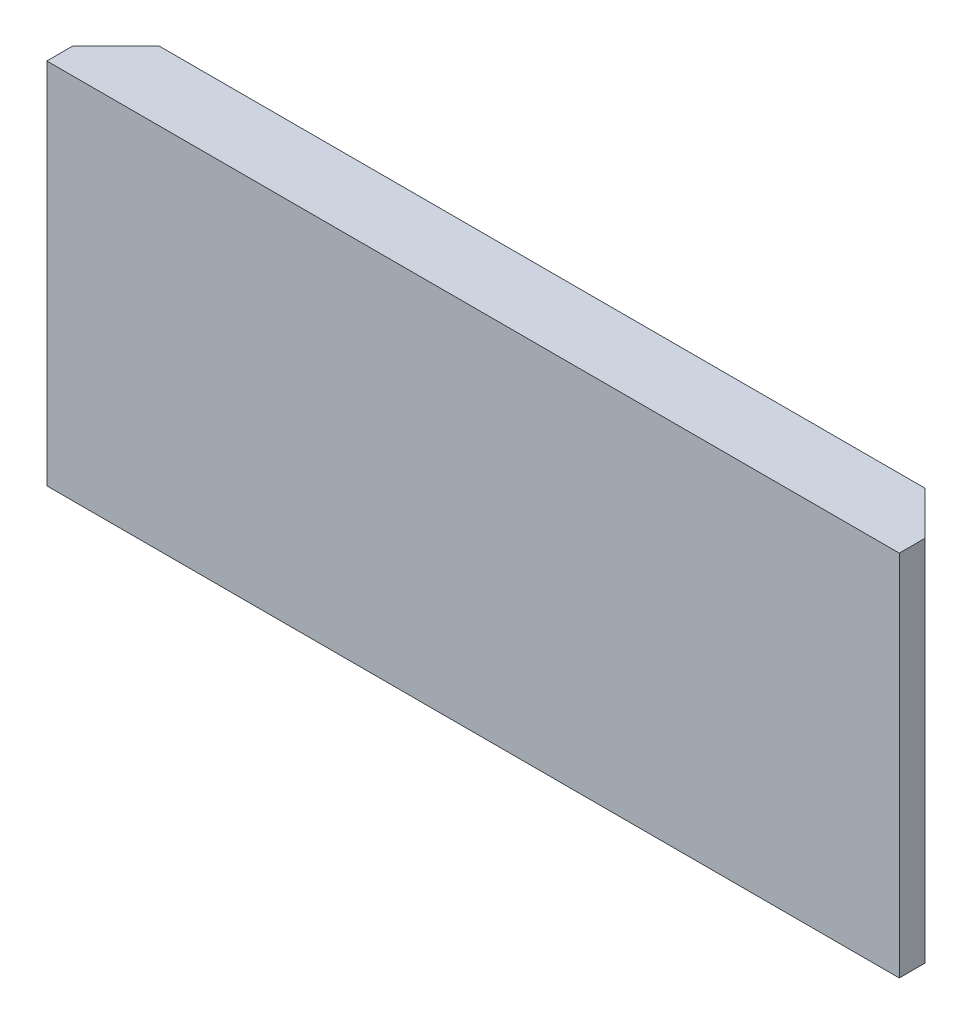
ISO-10303-21;
HEADER;
FILE_DESCRIPTION(('STEP AP214'),'2;1');
FILE_NAME('part.step','',(''),(''),'','','');
FILE_SCHEMA(('AUTOMOTIVE_DESIGN { 1 0 10303 214 1 1 1 1 }'));
ENDSEC;
DATA;
#1=APPLICATION_CONTEXT('core data for automotive mechanical design processes');
#2=APPLICATION_PROTOCOL_DEFINITION('international standard','automotive_design',2000,#1);
#3=PRODUCT_CONTEXT('',#1,'mechanical');
#4=PRODUCT('Part','Part','',(#3));
#5=PRODUCT_RELATED_PRODUCT_CATEGORY('part','',(#4));
#6=PRODUCT_DEFINITION_FORMATION('','',#4);
#7=PRODUCT_DEFINITION_CONTEXT('part definition',#1,'design');
#8=PRODUCT_DEFINITION('design','',#6,#7);
#9=PRODUCT_DEFINITION_SHAPE('','',#8);
#10=(LENGTH_UNIT() NAMED_UNIT(*) SI_UNIT(.MILLI.,.METRE.));
#11=(NAMED_UNIT(*) PLANE_ANGLE_UNIT() SI_UNIT($,.RADIAN.));
#12=(NAMED_UNIT(*) SI_UNIT($,.STERADIAN.) SOLID_ANGLE_UNIT());
#13=UNCERTAINTY_MEASURE_WITH_UNIT(LENGTH_MEASURE(1.E-05),#10,'distance_accuracy_value','');
#14=(GEOMETRIC_REPRESENTATION_CONTEXT(3) GLOBAL_UNCERTAINTY_ASSIGNED_CONTEXT((#13)) GLOBAL_UNIT_ASSIGNED_CONTEXT((#10,
#11,#12)) REPRESENTATION_CONTEXT('',''));
#15=CARTESIAN_POINT('',(0.,0.,0.));
#16=DIRECTION('',(0.,0.,1.));
#17=DIRECTION('',(1.,0.,0.));
#18=AXIS2_PLACEMENT_3D('',#15,#16,#17);
#19=CARTESIAN_POINT('',(0.,0.,0.));
#20=DIRECTION('',(0.,0.,1.));
#21=DIRECTION('',(1.,0.,0.));
#22=AXIS2_PLACEMENT_3D('',#19,#20,#21);
#23=PLANE('',#22);
#24=DIRECTION('',(-1.,0.,0.));
#25=VECTOR('',#24,1.);
#26=CARTESIAN_POINT('',(0.,37.19439999931,0.));
#27=LINE('',#26,#25);
#28=CARTESIAN_POINT('',(119.05,37.19439999931,0.));
#29=VERTEX_POINT('',#28);
#30=CARTESIAN_POINT('',(-78.35,37.19439999931,0.));
#31=VERTEX_POINT('',#30);
#32=EDGE_CURVE('E11',#29,#31,#27,.T.);
#33=ORIENTED_EDGE('',*,*,#32,.F.);
#34=DIRECTION('',(0.,1.,0.));
#35=VECTOR('',#34,1.);
#36=CARTESIAN_POINT('',(119.05,47.19439999931,0.));
#37=LINE('',#36,#35);
#38=CARTESIAN_POINT('',(119.05,-38.0149669770275,0.));
#39=VERTEX_POINT('',#38);
#40=EDGE_CURVE('E135',#39,#29,#37,.T.);
#41=ORIENTED_EDGE('',*,*,#40,.F.);
#42=DIRECTION('',(1.,0.,0.));
#43=VECTOR('',#42,1.);
#44=CARTESIAN_POINT('',(-78.35,-38.0149669770275,0.));
#45=LINE('',#44,#43);
#46=CARTESIAN_POINT('',(-78.35,-38.0149669770275,0.));
#47=VERTEX_POINT('',#46);
#48=EDGE_CURVE('E72',#47,#39,#45,.T.);
#49=ORIENTED_EDGE('',*,*,#48,.F.);
#50=DIRECTION('',(0.,-1.,0.));
#51=VECTOR('',#50,1.);
#52=CARTESIAN_POINT('',(-78.35,47.19439999931,0.));
#53=LINE('',#52,#51);
#54=EDGE_CURVE('E136',#31,#47,#53,.T.);
#55=ORIENTED_EDGE('',*,*,#54,.F.);
#56=EDGE_LOOP('',(#33,#41,#49,#55));
#57=FACE_BOUND('',#56,.T.);
#58=ADVANCED_FACE('F39',(#57),#23,.F.);
#59=CARTESIAN_POINT('',(-78.35,47.19439999931,6.));
#60=DIRECTION('',(1.,0.,0.));
#61=DIRECTION('',(0.,1.,0.));
#62=AXIS2_PLACEMENT_3D('',#59,#60,#61);
#63=PLANE('',#62);
#64=CARTESIAN_POINT('',(-78.35,47.19439999931,0.));
#65=VERTEX_POINT('',#64);
#66=EDGE_CURVE('E147',#65,#31,#53,.T.);
#67=ORIENTED_EDGE('',*,*,#66,.T.);
#68=ORIENTED_EDGE('',*,*,#54,.T.);
#69=DIRECTION('',(0.,0.,-1.));
#70=VECTOR('',#69,1.);
#71=CARTESIAN_POINT('',(-78.35,-38.0149669770275,6.));
#72=LINE('',#71,#70);
#73=CARTESIAN_POINT('',(-78.35,-38.0149669770275,6.));
#74=VERTEX_POINT('',#73);
#75=EDGE_CURVE('E49',#74,#47,#72,.T.);
#76=ORIENTED_EDGE('',*,*,#75,.F.);
#77=DIRECTION('',(0.,-1.,0.));
#78=VECTOR('',#77,1.);
#79=CARTESIAN_POINT('',(-78.35,47.19439999931,6.));
#80=LINE('',#79,#78);
#81=CARTESIAN_POINT('',(-78.35,47.19439999931,6.));
#82=VERTEX_POINT('',#81);
#83=EDGE_CURVE('E84',#82,#74,#80,.T.);
#84=ORIENTED_EDGE('',*,*,#83,.F.);
#85=DIRECTION('',(0.,0.,-1.));
#86=VECTOR('',#85,1.);
#87=CARTESIAN_POINT('',(-78.35,47.19439999931,6.));
#88=LINE('',#87,#86);
#89=EDGE_CURVE('E151',#82,#65,#88,.T.);
#90=ORIENTED_EDGE('',*,*,#89,.T.);
#91=EDGE_LOOP('',(#67,#68,#76,#84,#90));
#92=FACE_BOUND('',#91,.T.);
#93=ADVANCED_FACE('F41',(#92),#63,.F.);
#94=CARTESIAN_POINT('',(-78.35,-38.0149669770275,6.));
#95=DIRECTION('',(0.,1.,0.));
#96=DIRECTION('',(0.,0.,1.));
#97=AXIS2_PLACEMENT_3D('',#94,#95,#96);
#98=PLANE('',#97);
#99=ORIENTED_EDGE('',*,*,#48,.T.);
#100=DIRECTION('',(0.,0.,-1.));
#101=VECTOR('',#100,1.);
#102=CARTESIAN_POINT('',(119.05,-38.0149669770275,6.));
#103=LINE('',#102,#101);
#104=CARTESIAN_POINT('',(119.05,-38.0149669770275,6.));
#105=VERTEX_POINT('',#104);
#106=EDGE_CURVE('E140',#105,#39,#103,.T.);
#107=ORIENTED_EDGE('',*,*,#106,.F.);
#108=DIRECTION('',(1.,0.,0.));
#109=VECTOR('',#108,1.);
#110=CARTESIAN_POINT('',(-78.35,-38.0149669770275,6.));
#111=LINE('',#110,#109);
#112=EDGE_CURVE('E145',#74,#105,#111,.T.);
#113=ORIENTED_EDGE('',*,*,#112,.F.);
#114=ORIENTED_EDGE('',*,*,#75,.T.);
#115=EDGE_LOOP('',(#99,#107,#113,#114));
#116=FACE_BOUND('',#115,.T.);
#117=ADVANCED_FACE('F161',(#116),#98,.F.);
#118=CARTESIAN_POINT('',(119.05,47.19439999931,6.));
#119=DIRECTION('',(-1.,0.,0.));
#120=DIRECTION('',(0.,0.,1.));
#121=AXIS2_PLACEMENT_3D('',#118,#119,#120);
#122=PLANE('',#121);
#123=DIRECTION('',(0.,0.,-1.));
#124=VECTOR('',#123,1.);
#125=CARTESIAN_POINT('',(119.05,47.19439999931,6.));
#126=LINE('',#125,#124);
#127=CARTESIAN_POINT('',(119.05,47.19439999931,6.));
#128=VERTEX_POINT('',#127);
#129=CARTESIAN_POINT('',(119.05,47.19439999931,0.));
#130=VERTEX_POINT('',#129);
#131=EDGE_CURVE('E155',#128,#130,#126,.T.);
#132=ORIENTED_EDGE('',*,*,#131,.F.);
#133=DIRECTION('',(0.,1.,0.));
#134=VECTOR('',#133,1.);
#135=CARTESIAN_POINT('',(119.05,47.19439999931,6.));
#136=LINE('',#135,#134);
#137=EDGE_CURVE('E171',#105,#128,#136,.T.);
#138=ORIENTED_EDGE('',*,*,#137,.F.);
#139=ORIENTED_EDGE('',*,*,#106,.T.);
#140=ORIENTED_EDGE('',*,*,#40,.T.);
#141=DIRECTION('',(0.,1.,0.));
#142=VECTOR('',#141,1.);
#143=CARTESIAN_POINT('',(119.05,37.19439999931,0.));
#144=LINE('',#143,#142);
#145=EDGE_CURVE('E108',#29,#130,#144,.T.);
#146=ORIENTED_EDGE('',*,*,#145,.T.);
#147=EDGE_LOOP('',(#132,#138,#139,#140,#146));
#148=FACE_BOUND('',#147,.T.);
#149=ADVANCED_FACE('F138',(#148),#122,.F.);
#150=CARTESIAN_POINT('',(-78.35,47.19439999931,6.));
#151=DIRECTION('',(0.,-1.,0.));
#152=DIRECTION('',(0.,0.,-1.));
#153=AXIS2_PLACEMENT_3D('',#150,#151,#152);
#154=PLANE('',#153);
#155=ORIENTED_EDGE('',*,*,#131,.T.);
#156=DIRECTION('',(-0.707106781186553,0.,-0.707106781186542));
#157=VECTOR('',#156,1.);
#158=CARTESIAN_POINT('',(119.05,47.19439999931,0.));
#159=LINE('',#158,#157);
#160=CARTESIAN_POINT('',(109.05,47.19439999931,-10.));
#161=VERTEX_POINT('',#160);
#162=EDGE_CURVE('E113',#130,#161,#159,.T.);
#163=ORIENTED_EDGE('',*,*,#162,.T.);
#164=DIRECTION('',(-1.,0.,0.));
#165=VECTOR('',#164,1.);
#166=CARTESIAN_POINT('',(-68.35,47.19439999931,-10.));
#167=LINE('',#166,#165);
#168=CARTESIAN_POINT('',(-68.35,47.19439999931,-10.));
#169=VERTEX_POINT('',#168);
#170=EDGE_CURVE('E180',#161,#169,#167,.T.);
#171=ORIENTED_EDGE('',*,*,#170,.T.);
#172=DIRECTION('',(-0.707106781186546,0.,0.707106781186549));
#173=VECTOR('',#172,1.);
#174=CARTESIAN_POINT('',(-78.35,47.19439999931,0.));
#175=LINE('',#174,#173);
#176=EDGE_CURVE('E79',#169,#65,#175,.T.);
#177=ORIENTED_EDGE('',*,*,#176,.T.);
#178=ORIENTED_EDGE('',*,*,#89,.F.);
#179=DIRECTION('',(-1.,0.,0.));
#180=VECTOR('',#179,1.);
#181=CARTESIAN_POINT('',(-78.35,47.19439999931,6.));
#182=LINE('',#181,#180);
#183=EDGE_CURVE('E57',#128,#82,#182,.T.);
#184=ORIENTED_EDGE('',*,*,#183,.F.);
#185=EDGE_LOOP('',(#155,#163,#171,#177,#178,#184));
#186=FACE_BOUND('',#185,.T.);
#187=ADVANCED_FACE('F193',(#186),#154,.F.);
#188=CARTESIAN_POINT('',(0.,0.,6.));
#189=DIRECTION('',(0.,0.,1.));
#190=DIRECTION('',(1.,0.,0.));
#191=AXIS2_PLACEMENT_3D('',#188,#189,#190);
#192=PLANE('',#191);
#193=ORIENTED_EDGE('',*,*,#83,.T.);
#194=ORIENTED_EDGE('',*,*,#112,.T.);
#195=ORIENTED_EDGE('',*,*,#137,.T.);
#196=ORIENTED_EDGE('',*,*,#183,.T.);
#197=EDGE_LOOP('',(#193,#194,#195,#196));
#198=FACE_BOUND('',#197,.T.);
#199=ADVANCED_FACE('F194',(#198),#192,.T.);
#200=CARTESIAN_POINT('',(0.,37.19439999931,0.));
#201=DIRECTION('',(0.,1.,0.));
#202=DIRECTION('',(0.,0.,1.));
#203=AXIS2_PLACEMENT_3D('',#200,#201,#202);
#204=PLANE('',#203);
#205=DIRECTION('',(-0.707106781186553,0.,-0.707106781186542));
#206=VECTOR('',#205,1.);
#207=CARTESIAN_POINT('',(119.05,37.19439999931,0.));
#208=LINE('',#207,#206);
#209=CARTESIAN_POINT('',(109.05,37.19439999931,-10.));
#210=VERTEX_POINT('',#209);
#211=EDGE_CURVE('E111',#29,#210,#208,.T.);
#212=ORIENTED_EDGE('',*,*,#211,.F.);
#213=ORIENTED_EDGE('',*,*,#32,.T.);
#214=DIRECTION('',(-0.707106781186546,0.,0.707106781186549));
#215=VECTOR('',#214,1.);
#216=CARTESIAN_POINT('',(-78.35,37.19439999931,0.));
#217=LINE('',#216,#215);
#218=CARTESIAN_POINT('',(-68.35,37.19439999931,-10.));
#219=VERTEX_POINT('',#218);
#220=EDGE_CURVE('E120',#219,#31,#217,.T.);
#221=ORIENTED_EDGE('',*,*,#220,.F.);
#222=DIRECTION('',(-1.,0.,0.));
#223=VECTOR('',#222,1.);
#224=CARTESIAN_POINT('',(-68.35,37.19439999931,-10.));
#225=LINE('',#224,#223);
#226=EDGE_CURVE('E129',#210,#219,#225,.T.);
#227=ORIENTED_EDGE('',*,*,#226,.F.);
#228=EDGE_LOOP('',(#212,#213,#221,#227));
#229=FACE_BOUND('',#228,.T.);
#230=ADVANCED_FACE('F125',(#229),#204,.F.);
#231=CARTESIAN_POINT('',(-78.35,37.19439999931,0.));
#232=DIRECTION('',(-0.707106781186549,0.,-0.707106781186546));
#233=DIRECTION('',(-0.707106781186546,0.,0.707106781186549));
#234=AXIS2_PLACEMENT_3D('',#231,#232,#233);
#235=PLANE('',#234);
#236=ORIENTED_EDGE('',*,*,#176,.F.);
#237=DIRECTION('',(0.,1.,0.));
#238=VECTOR('',#237,1.);
#239=CARTESIAN_POINT('',(-68.35,37.19439999931,-10.));
#240=LINE('',#239,#238);
#241=EDGE_CURVE('E164',#219,#169,#240,.T.);
#242=ORIENTED_EDGE('',*,*,#241,.F.);
#243=ORIENTED_EDGE('',*,*,#220,.T.);
#244=ORIENTED_EDGE('',*,*,#66,.F.);
#245=EDGE_LOOP('',(#236,#242,#243,#244));
#246=FACE_BOUND('',#245,.T.);
#247=ADVANCED_FACE('F192',(#246),#235,.T.);
#248=CARTESIAN_POINT('',(-68.35,37.19439999931,-10.));
#249=DIRECTION('',(0.,0.,-1.));
#250=DIRECTION('',(-1.,0.,0.));
#251=AXIS2_PLACEMENT_3D('',#248,#249,#250);
#252=PLANE('',#251);
#253=ORIENTED_EDGE('',*,*,#170,.F.);
#254=DIRECTION('',(0.,1.,0.));
#255=VECTOR('',#254,1.);
#256=CARTESIAN_POINT('',(109.05,37.19439999931,-10.));
#257=LINE('',#256,#255);
#258=EDGE_CURVE('E119',#210,#161,#257,.T.);
#259=ORIENTED_EDGE('',*,*,#258,.F.);
#260=ORIENTED_EDGE('',*,*,#226,.T.);
#261=ORIENTED_EDGE('',*,*,#241,.T.);
#262=EDGE_LOOP('',(#253,#259,#260,#261));
#263=FACE_BOUND('',#262,.T.);
#264=ADVANCED_FACE('F190',(#263),#252,.T.);
#265=CARTESIAN_POINT('',(119.05,37.19439999931,0.));
#266=DIRECTION('',(0.707106781186542,0.,-0.707106781186553));
#267=DIRECTION('',(-0.707106781186553,0.,-0.707106781186542));
#268=AXIS2_PLACEMENT_3D('',#265,#266,#267);
#269=PLANE('',#268);
#270=ORIENTED_EDGE('',*,*,#162,.F.);
#271=ORIENTED_EDGE('',*,*,#145,.F.);
#272=ORIENTED_EDGE('',*,*,#211,.T.);
#273=ORIENTED_EDGE('',*,*,#258,.T.);
#274=EDGE_LOOP('',(#270,#271,#272,#273));
#275=FACE_BOUND('',#274,.T.);
#276=ADVANCED_FACE('F110',(#275),#269,.T.);
#277=CLOSED_SHELL('',(#58,#93,#117,#149,#187,#199,#230,#247,#264,#276));
#278=MANIFOLD_SOLID_BREP('B2',#277);
#279=ADVANCED_BREP_SHAPE_REPRESENTATION('',(#18,#278),#14);
#280=SHAPE_DEFINITION_REPRESENTATION(#9,#279);
ENDSEC;
END-ISO-10303-21;
